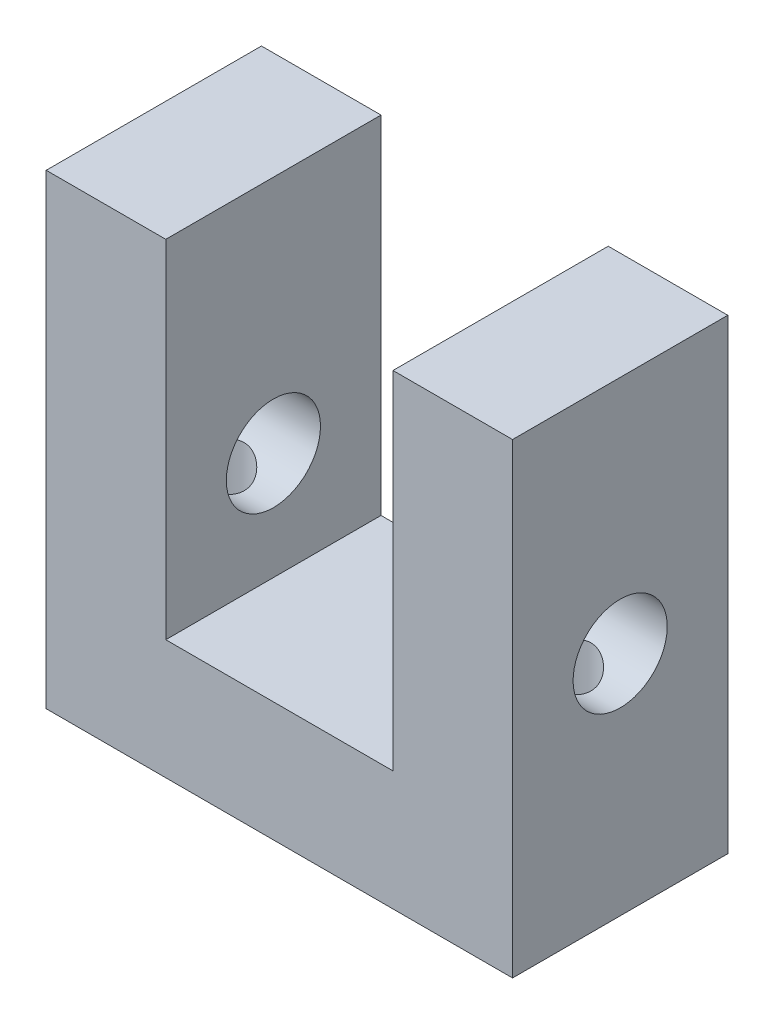
ISO-10303-21;
HEADER;
FILE_DESCRIPTION(('STEP AP214'),'2;1');
FILE_NAME('part.step','',(''),(''),'','','');
FILE_SCHEMA(('AUTOMOTIVE_DESIGN { 1 0 10303 214 1 1 1 1 }'));
ENDSEC;
DATA;
#1=APPLICATION_CONTEXT('core data for automotive mechanical design processes');
#2=APPLICATION_PROTOCOL_DEFINITION('international standard','automotive_design',2000,#1);
#3=PRODUCT_CONTEXT('',#1,'mechanical');
#4=PRODUCT('Part','Part','',(#3));
#5=PRODUCT_RELATED_PRODUCT_CATEGORY('part','',(#4));
#6=PRODUCT_DEFINITION_FORMATION('','',#4);
#7=PRODUCT_DEFINITION_CONTEXT('part definition',#1,'design');
#8=PRODUCT_DEFINITION('design','',#6,#7);
#9=PRODUCT_DEFINITION_SHAPE('','',#8);
#10=(LENGTH_UNIT() NAMED_UNIT(*) SI_UNIT(.MILLI.,.METRE.));
#11=(NAMED_UNIT(*) PLANE_ANGLE_UNIT() SI_UNIT($,.RADIAN.));
#12=(NAMED_UNIT(*) SI_UNIT($,.STERADIAN.) SOLID_ANGLE_UNIT());
#13=UNCERTAINTY_MEASURE_WITH_UNIT(LENGTH_MEASURE(1.E-05),#10,'distance_accuracy_value','');
#14=(GEOMETRIC_REPRESENTATION_CONTEXT(3) GLOBAL_UNCERTAINTY_ASSIGNED_CONTEXT((#13)) GLOBAL_UNIT_ASSIGNED_CONTEXT((#10,
#11,#12)) REPRESENTATION_CONTEXT('',''));
#15=CARTESIAN_POINT('',(0.,0.,0.));
#16=DIRECTION('',(0.,0.,1.));
#17=DIRECTION('',(1.,0.,0.));
#18=AXIS2_PLACEMENT_3D('',#15,#16,#17);
#19=CARTESIAN_POINT('',(-19.5,39.,18.));
#20=DIRECTION('',(1.,0.,0.));
#21=DIRECTION('',(0.,1.,0.));
#22=AXIS2_PLACEMENT_3D('',#19,#20,#21);
#23=PLANE('',#22);
#24=CARTESIAN_POINT('',(-19.5,19.,9.));
#25=DIRECTION('',(1.,0.,0.));
#26=DIRECTION('',(0.,1.,0.));
#27=AXIS2_PLACEMENT_3D('',#24,#25,#26);
#28=CIRCLE('',#27,3.937);
#29=CARTESIAN_POINT('',(-19.5,22.937,9.));
#30=VERTEX_POINT('',#29);
#31=EDGE_CURVE('E168',#30,#30,#28,.T.);
#32=ORIENTED_EDGE('',*,*,#31,.T.);
#33=EDGE_LOOP('',(#32));
#34=FACE_BOUND('',#33,.T.);
#35=DIRECTION('',(0.,-1.,0.));
#36=VECTOR('',#35,1.);
#37=CARTESIAN_POINT('',(-19.5,39.,0.));
#38=LINE('',#37,#36);
#39=CARTESIAN_POINT('',(-19.5,39.,0.));
#40=VERTEX_POINT('',#39);
#41=CARTESIAN_POINT('',(-19.5,0.,0.));
#42=VERTEX_POINT('',#41);
#43=EDGE_CURVE('E139',#40,#42,#38,.T.);
#44=ORIENTED_EDGE('',*,*,#43,.T.);
#45=DIRECTION('',(0.,0.,-1.));
#46=VECTOR('',#45,1.);
#47=CARTESIAN_POINT('',(-19.5,0.,18.));
#48=LINE('',#47,#46);
#49=CARTESIAN_POINT('',(-19.5,0.,18.));
#50=VERTEX_POINT('',#49);
#51=EDGE_CURVE('E11',#50,#42,#48,.T.);
#52=ORIENTED_EDGE('',*,*,#51,.F.);
#53=DIRECTION('',(0.,-1.,0.));
#54=VECTOR('',#53,1.);
#55=CARTESIAN_POINT('',(-19.5,39.,18.));
#56=LINE('',#55,#54);
#57=CARTESIAN_POINT('',(-19.5,39.,18.));
#58=VERTEX_POINT('',#57);
#59=EDGE_CURVE('E154',#58,#50,#56,.T.);
#60=ORIENTED_EDGE('',*,*,#59,.F.);
#61=DIRECTION('',(0.,0.,-1.));
#62=VECTOR('',#61,1.);
#63=CARTESIAN_POINT('',(-19.5,39.,18.));
#64=LINE('',#63,#62);
#65=EDGE_CURVE('E135',#58,#40,#64,.T.);
#66=ORIENTED_EDGE('',*,*,#65,.T.);
#67=EDGE_LOOP('',(#44,#52,#60,#66));
#68=FACE_BOUND('',#67,.T.);
#69=ADVANCED_FACE('F37',(#34,#68),#23,.F.);
#70=CARTESIAN_POINT('',(-19.5,0.,18.));
#71=DIRECTION('',(0.,1.,0.));
#72=DIRECTION('',(0.,0.,1.));
#73=AXIS2_PLACEMENT_3D('',#70,#71,#72);
#74=PLANE('',#73);
#75=CARTESIAN_POINT('',(-14.5,0.,9.));
#76=DIRECTION('',(0.,-1.,0.));
#77=DIRECTION('',(0.,0.,-1.));
#78=AXIS2_PLACEMENT_3D('',#75,#76,#77);
#79=CIRCLE('',#78,2.55269999999999);
#80=CARTESIAN_POINT('',(-14.5,0.,6.44730000000001));
#81=VERTEX_POINT('',#80);
#82=EDGE_CURVE('E228',#81,#81,#79,.T.);
#83=ORIENTED_EDGE('',*,*,#82,.F.);
#84=EDGE_LOOP('',(#83));
#85=FACE_BOUND('',#84,.T.);
#86=CARTESIAN_POINT('',(14.5,0.,9.));
#87=DIRECTION('',(0.,-1.,0.));
#88=DIRECTION('',(0.,0.,-1.));
#89=AXIS2_PLACEMENT_3D('',#86,#87,#88);
#90=CIRCLE('',#89,2.55269999999999);
#91=CARTESIAN_POINT('',(14.5,0.,6.44730000000002));
#92=VERTEX_POINT('',#91);
#93=EDGE_CURVE('E175',#92,#92,#90,.T.);
#94=ORIENTED_EDGE('',*,*,#93,.F.);
#95=EDGE_LOOP('',(#94));
#96=FACE_BOUND('',#95,.T.);
#97=DIRECTION('',(1.,0.,0.));
#98=VECTOR('',#97,1.);
#99=CARTESIAN_POINT('',(-19.5,0.,0.));
#100=LINE('',#99,#98);
#101=CARTESIAN_POINT('',(19.5,0.,0.));
#102=VERTEX_POINT('',#101);
#103=EDGE_CURVE('E142',#42,#102,#100,.T.);
#104=ORIENTED_EDGE('',*,*,#103,.T.);
#105=DIRECTION('',(0.,0.,-1.));
#106=VECTOR('',#105,1.);
#107=CARTESIAN_POINT('',(19.5,0.,18.));
#108=LINE('',#107,#106);
#109=CARTESIAN_POINT('',(19.5,0.,18.));
#110=VERTEX_POINT('',#109);
#111=EDGE_CURVE('E50',#110,#102,#108,.T.);
#112=ORIENTED_EDGE('',*,*,#111,.F.);
#113=DIRECTION('',(1.,0.,0.));
#114=VECTOR('',#113,1.);
#115=CARTESIAN_POINT('',(-19.5,0.,18.));
#116=LINE('',#115,#114);
#117=EDGE_CURVE('E102',#50,#110,#116,.T.);
#118=ORIENTED_EDGE('',*,*,#117,.F.);
#119=ORIENTED_EDGE('',*,*,#51,.T.);
#120=EDGE_LOOP('',(#104,#112,#118,#119));
#121=FACE_BOUND('',#120,.T.);
#122=ADVANCED_FACE('F192',(#85,#96,#121),#74,.F.);
#123=CARTESIAN_POINT('',(19.5,0.,18.));
#124=DIRECTION('',(-1.,0.,0.));
#125=DIRECTION('',(0.,-1.,0.));
#126=AXIS2_PLACEMENT_3D('',#123,#124,#125);
#127=PLANE('',#126);
#128=CARTESIAN_POINT('',(19.5,19.,9.));
#129=DIRECTION('',(1.,0.,0.));
#130=DIRECTION('',(0.,1.,0.));
#131=AXIS2_PLACEMENT_3D('',#128,#129,#130);
#132=CIRCLE('',#131,3.937);
#133=CARTESIAN_POINT('',(19.5,22.937,9.));
#134=VERTEX_POINT('',#133);
#135=EDGE_CURVE('E174',#134,#134,#132,.T.);
#136=ORIENTED_EDGE('',*,*,#135,.F.);
#137=EDGE_LOOP('',(#136));
#138=FACE_BOUND('',#137,.T.);
#139=DIRECTION('',(0.,1.,0.));
#140=VECTOR('',#139,1.);
#141=CARTESIAN_POINT('',(19.5,0.,0.));
#142=LINE('',#141,#140);
#143=CARTESIAN_POINT('',(19.5,39.,0.));
#144=VERTEX_POINT('',#143);
#145=EDGE_CURVE('E145',#102,#144,#142,.T.);
#146=ORIENTED_EDGE('',*,*,#145,.T.);
#147=DIRECTION('',(0.,0.,-1.));
#148=VECTOR('',#147,1.);
#149=CARTESIAN_POINT('',(19.5,39.,18.));
#150=LINE('',#149,#148);
#151=CARTESIAN_POINT('',(19.5,39.,18.));
#152=VERTEX_POINT('',#151);
#153=EDGE_CURVE('E161',#152,#144,#150,.T.);
#154=ORIENTED_EDGE('',*,*,#153,.F.);
#155=DIRECTION('',(0.,1.,0.));
#156=VECTOR('',#155,1.);
#157=CARTESIAN_POINT('',(19.5,0.,18.));
#158=LINE('',#157,#156);
#159=EDGE_CURVE('E213',#110,#152,#158,.T.);
#160=ORIENTED_EDGE('',*,*,#159,.F.);
#161=ORIENTED_EDGE('',*,*,#111,.T.);
#162=EDGE_LOOP('',(#146,#154,#160,#161));
#163=FACE_BOUND('',#162,.T.);
#164=ADVANCED_FACE('F198',(#138,#163),#127,.F.);
#165=CARTESIAN_POINT('',(19.5,39.,18.));
#166=DIRECTION('',(0.,-1.,0.));
#167=DIRECTION('',(0.,0.,-1.));
#168=AXIS2_PLACEMENT_3D('',#165,#166,#167);
#169=PLANE('',#168);
#170=DIRECTION('',(-1.,0.,0.));
#171=VECTOR('',#170,1.);
#172=CARTESIAN_POINT('',(19.5,39.,0.));
#173=LINE('',#172,#171);
#174=CARTESIAN_POINT('',(9.5,39.,0.));
#175=VERTEX_POINT('',#174);
#176=EDGE_CURVE('E147',#144,#175,#173,.T.);
#177=ORIENTED_EDGE('',*,*,#176,.T.);
#178=DIRECTION('',(0.,0.,-1.));
#179=VECTOR('',#178,1.);
#180=CARTESIAN_POINT('',(9.5,39.,18.));
#181=LINE('',#180,#179);
#182=CARTESIAN_POINT('',(9.5,39.,18.));
#183=VERTEX_POINT('',#182);
#184=EDGE_CURVE('E158',#183,#175,#181,.T.);
#185=ORIENTED_EDGE('',*,*,#184,.F.);
#186=DIRECTION('',(-1.,0.,0.));
#187=VECTOR('',#186,1.);
#188=CARTESIAN_POINT('',(19.5,39.,18.));
#189=LINE('',#188,#187);
#190=EDGE_CURVE('E215',#152,#183,#189,.T.);
#191=ORIENTED_EDGE('',*,*,#190,.F.);
#192=ORIENTED_EDGE('',*,*,#153,.T.);
#193=EDGE_LOOP('',(#177,#185,#191,#192));
#194=FACE_BOUND('',#193,.T.);
#195=ADVANCED_FACE('F253',(#194),#169,.F.);
#196=CARTESIAN_POINT('',(9.5,39.,18.));
#197=DIRECTION('',(1.,0.,0.));
#198=DIRECTION('',(0.,1.,0.));
#199=AXIS2_PLACEMENT_3D('',#196,#197,#198);
#200=PLANE('',#199);
#201=CARTESIAN_POINT('',(9.50000000000001,19.,9.));
#202=DIRECTION('',(1.,0.,0.));
#203=DIRECTION('',(0.,1.,0.));
#204=AXIS2_PLACEMENT_3D('',#201,#202,#203);
#205=CIRCLE('',#204,3.937);
#206=CARTESIAN_POINT('',(9.50000000000001,22.937,9.));
#207=VERTEX_POINT('',#206);
#208=EDGE_CURVE('E143',#207,#207,#205,.T.);
#209=ORIENTED_EDGE('',*,*,#208,.T.);
#210=EDGE_LOOP('',(#209));
#211=FACE_BOUND('',#210,.T.);
#212=DIRECTION('',(0.,-1.,0.));
#213=VECTOR('',#212,1.);
#214=CARTESIAN_POINT('',(9.5,39.,0.));
#215=LINE('',#214,#213);
#216=CARTESIAN_POINT('',(9.5,10.,0.));
#217=VERTEX_POINT('',#216);
#218=EDGE_CURVE('E149',#175,#217,#215,.T.);
#219=ORIENTED_EDGE('',*,*,#218,.T.);
#220=DIRECTION('',(0.,0.,-1.));
#221=VECTOR('',#220,1.);
#222=CARTESIAN_POINT('',(9.5,10.,18.));
#223=LINE('',#222,#221);
#224=CARTESIAN_POINT('',(9.5,10.,18.));
#225=VERTEX_POINT('',#224);
#226=EDGE_CURVE('E130',#225,#217,#223,.T.);
#227=ORIENTED_EDGE('',*,*,#226,.F.);
#228=DIRECTION('',(0.,-1.,0.));
#229=VECTOR('',#228,1.);
#230=CARTESIAN_POINT('',(9.5,39.,18.));
#231=LINE('',#230,#229);
#232=EDGE_CURVE('E121',#183,#225,#231,.T.);
#233=ORIENTED_EDGE('',*,*,#232,.F.);
#234=ORIENTED_EDGE('',*,*,#184,.T.);
#235=EDGE_LOOP('',(#219,#227,#233,#234));
#236=FACE_BOUND('',#235,.T.);
#237=ADVANCED_FACE('F247',(#211,#236),#200,.F.);
#238=CARTESIAN_POINT('',(9.5,10.,18.));
#239=DIRECTION('',(0.,-1.,0.));
#240=DIRECTION('',(0.,0.,-1.));
#241=AXIS2_PLACEMENT_3D('',#238,#239,#240);
#242=PLANE('',#241);
#243=DIRECTION('',(-1.,0.,0.));
#244=VECTOR('',#243,1.);
#245=CARTESIAN_POINT('',(9.5,10.,0.));
#246=LINE('',#245,#244);
#247=CARTESIAN_POINT('',(-9.5,10.,0.));
#248=VERTEX_POINT('',#247);
#249=EDGE_CURVE('E129',#217,#248,#246,.T.);
#250=ORIENTED_EDGE('',*,*,#249,.T.);
#251=DIRECTION('',(0.,0.,-1.));
#252=VECTOR('',#251,1.);
#253=CARTESIAN_POINT('',(-9.5,10.,18.));
#254=LINE('',#253,#252);
#255=CARTESIAN_POINT('',(-9.5,10.,18.));
#256=VERTEX_POINT('',#255);
#257=EDGE_CURVE('E126',#256,#248,#254,.T.);
#258=ORIENTED_EDGE('',*,*,#257,.F.);
#259=DIRECTION('',(-1.,0.,0.));
#260=VECTOR('',#259,1.);
#261=CARTESIAN_POINT('',(9.5,10.,18.));
#262=LINE('',#261,#260);
#263=EDGE_CURVE('E115',#225,#256,#262,.T.);
#264=ORIENTED_EDGE('',*,*,#263,.F.);
#265=ORIENTED_EDGE('',*,*,#226,.T.);
#266=EDGE_LOOP('',(#250,#258,#264,#265));
#267=FACE_BOUND('',#266,.T.);
#268=ADVANCED_FACE('F127',(#267),#242,.F.);
#269=CARTESIAN_POINT('',(-9.5,10.,18.));
#270=DIRECTION('',(-1.,0.,0.));
#271=DIRECTION('',(0.,-1.,0.));
#272=AXIS2_PLACEMENT_3D('',#269,#270,#271);
#273=PLANE('',#272);
#274=CARTESIAN_POINT('',(-9.5,19.,9.));
#275=DIRECTION('',(-1.,0.,0.));
#276=DIRECTION('',(0.,-1.,0.));
#277=AXIS2_PLACEMENT_3D('',#274,#275,#276);
#278=CIRCLE('',#277,3.937);
#279=CARTESIAN_POINT('',(-9.5,15.063,9.));
#280=VERTEX_POINT('',#279);
#281=EDGE_CURVE('E166',#280,#280,#278,.T.);
#282=ORIENTED_EDGE('',*,*,#281,.T.);
#283=EDGE_LOOP('',(#282));
#284=FACE_BOUND('',#283,.T.);
#285=DIRECTION('',(0.,1.,0.));
#286=VECTOR('',#285,1.);
#287=CARTESIAN_POINT('',(-9.5,10.,0.));
#288=LINE('',#287,#286);
#289=CARTESIAN_POINT('',(-9.50000000000001,39.,0.));
#290=VERTEX_POINT('',#289);
#291=EDGE_CURVE('E88',#248,#290,#288,.T.);
#292=ORIENTED_EDGE('',*,*,#291,.T.);
#293=DIRECTION('',(0.,0.,-1.));
#294=VECTOR('',#293,1.);
#295=CARTESIAN_POINT('',(-9.50000000000001,39.,18.));
#296=LINE('',#295,#294);
#297=CARTESIAN_POINT('',(-9.50000000000001,39.,18.));
#298=VERTEX_POINT('',#297);
#299=EDGE_CURVE('E131',#298,#290,#296,.T.);
#300=ORIENTED_EDGE('',*,*,#299,.F.);
#301=DIRECTION('',(0.,1.,0.));
#302=VECTOR('',#301,1.);
#303=CARTESIAN_POINT('',(-9.5,10.,18.));
#304=LINE('',#303,#302);
#305=EDGE_CURVE('E119',#256,#298,#304,.T.);
#306=ORIENTED_EDGE('',*,*,#305,.F.);
#307=ORIENTED_EDGE('',*,*,#257,.T.);
#308=EDGE_LOOP('',(#292,#300,#306,#307));
#309=FACE_BOUND('',#308,.T.);
#310=ADVANCED_FACE('F133',(#284,#309),#273,.F.);
#311=CARTESIAN_POINT('',(-9.50000000000001,39.,18.));
#312=DIRECTION('',(0.,-1.,0.));
#313=DIRECTION('',(1.,0.,0.));
#314=AXIS2_PLACEMENT_3D('',#311,#312,#313);
#315=PLANE('',#314);
#316=DIRECTION('',(-1.,0.,0.));
#317=VECTOR('',#316,1.);
#318=CARTESIAN_POINT('',(-9.50000000000001,39.,0.));
#319=LINE('',#318,#317);
#320=EDGE_CURVE('E94',#290,#40,#319,.T.);
#321=ORIENTED_EDGE('',*,*,#320,.T.);
#322=ORIENTED_EDGE('',*,*,#65,.F.);
#323=DIRECTION('',(-1.,0.,0.));
#324=VECTOR('',#323,1.);
#325=CARTESIAN_POINT('',(-9.50000000000001,39.,18.));
#326=LINE('',#325,#324);
#327=EDGE_CURVE('E59',#298,#58,#326,.T.);
#328=ORIENTED_EDGE('',*,*,#327,.F.);
#329=ORIENTED_EDGE('',*,*,#299,.T.);
#330=EDGE_LOOP('',(#321,#322,#328,#329));
#331=FACE_BOUND('',#330,.T.);
#332=ADVANCED_FACE('F240',(#331),#315,.F.);
#333=CARTESIAN_POINT('',(0.,0.,18.));
#334=DIRECTION('',(0.,0.,1.));
#335=DIRECTION('',(1.,0.,0.));
#336=AXIS2_PLACEMENT_3D('',#333,#334,#335);
#337=PLANE('',#336);
#338=ORIENTED_EDGE('',*,*,#59,.T.);
#339=ORIENTED_EDGE('',*,*,#117,.T.);
#340=ORIENTED_EDGE('',*,*,#159,.T.);
#341=ORIENTED_EDGE('',*,*,#190,.T.);
#342=ORIENTED_EDGE('',*,*,#232,.T.);
#343=ORIENTED_EDGE('',*,*,#263,.T.);
#344=ORIENTED_EDGE('',*,*,#305,.T.);
#345=ORIENTED_EDGE('',*,*,#327,.T.);
#346=EDGE_LOOP('',(#338,#339,#340,#341,#342,#343,#344,#345));
#347=FACE_BOUND('',#346,.T.);
#348=ADVANCED_FACE('F117',(#347),#337,.T.);
#349=CARTESIAN_POINT('',(0.,0.,0.));
#350=DIRECTION('',(0.,0.,1.));
#351=DIRECTION('',(1.,0.,0.));
#352=AXIS2_PLACEMENT_3D('',#349,#350,#351);
#353=PLANE('',#352);
#354=ORIENTED_EDGE('',*,*,#43,.F.);
#355=ORIENTED_EDGE('',*,*,#320,.F.);
#356=ORIENTED_EDGE('',*,*,#291,.F.);
#357=ORIENTED_EDGE('',*,*,#249,.F.);
#358=ORIENTED_EDGE('',*,*,#218,.F.);
#359=ORIENTED_EDGE('',*,*,#176,.F.);
#360=ORIENTED_EDGE('',*,*,#145,.F.);
#361=ORIENTED_EDGE('',*,*,#103,.F.);
#362=EDGE_LOOP('',(#354,#355,#356,#357,#358,#359,#360,#361));
#363=FACE_BOUND('',#362,.T.);
#364=ADVANCED_FACE('F207',(#363),#353,.F.);
#365=CARTESIAN_POINT('',(-19.5,19.,9.));
#366=DIRECTION('',(1.,0.,0.));
#367=DIRECTION('',(0.,1.,0.));
#368=AXIS2_PLACEMENT_3D('',#365,#366,#367);
#369=CYLINDRICAL_SURFACE('',#368,3.937);
#370=CARTESIAN_POINT('',(-14.5,16.002719280748,6.44730000000001));
#371=CARTESIAN_POINT('',(-14.4371393728023,16.0027223438406,6.44729812919539));
#372=CARTESIAN_POINT('',(-14.3742955930967,16.0007329534528,6.44962640561601));
#373=CARTESIAN_POINT('',(-14.249182800711,15.9928924859204,6.45887669833673));
#374=CARTESIAN_POINT('',(-14.1869139477669,15.9870403664721,6.46579995453093));
#375=CARTESIAN_POINT('',(-14.0016374740319,15.964031845289,6.49331478376425));
#376=CARTESIAN_POINT('',(-13.8802329113491,15.9414237453145,6.52065120482433));
#377=CARTESIAN_POINT('',(-13.6462229835699,15.8855624013916,6.591222675012));
#378=CARTESIAN_POINT('',(-13.5335485930963,15.8524062380573,6.63431324821302));
#379=CARTESIAN_POINT('',(-13.3171555717831,15.7793727051945,6.73474337339725));
#380=CARTESIAN_POINT('',(-13.2134389287416,15.7394938496109,6.79208607715466));
#381=CARTESIAN_POINT('',(-13.001347954788,15.6505135439433,6.92912997279824));
#382=CARTESIAN_POINT('',(-12.8945005518559,15.600915287351,7.01087233643893));
#383=CARTESIAN_POINT('',(-12.694733730064,15.502122363775,7.19020855036278));
#384=CARTESIAN_POINT('',(-12.6018270057242,15.4529281027385,7.28781668172087));
#385=CARTESIAN_POINT('',(-12.4201953635803,15.3527004116614,7.51200962350713));
#386=CARTESIAN_POINT('',(-12.3336867966122,15.3022990906964,7.64072345198957));
#387=CARTESIAN_POINT('',(-12.2216785445867,15.2352205158734,7.84603821084825));
#388=CARTESIAN_POINT('',(-12.1872945487938,15.2142769725733,7.91653820567028));
#389=CARTESIAN_POINT('',(-12.1249012540365,15.1758429338826,8.06118560469413));
#390=CARTESIAN_POINT('',(-12.0968873637527,15.1583499526767,8.13533033473717));
#391=CARTESIAN_POINT('',(-12.0503356815028,15.1290495490551,8.27856223048723));
#392=CARTESIAN_POINT('',(-12.0311046045123,15.1168340079681,8.34734144415776));
#393=CARTESIAN_POINT('',(-11.9984058645738,15.0959628344503,8.48674990310246));
#394=CARTESIAN_POINT('',(-11.9849347574645,15.087305074773,8.5573780159416));
#395=CARTESIAN_POINT('',(-11.9639884614258,15.0738083015734,8.69983498692896));
#396=CARTESIAN_POINT('',(-11.956509059794,15.0689666050577,8.77166296512819));
#397=CARTESIAN_POINT('',(-11.9476646418764,15.0632374836349,8.91582544316401));
#398=CARTESIAN_POINT('',(-11.9462988363941,15.062349548342,8.98815987641546));
#399=CARTESIAN_POINT('',(-11.9509499746763,15.0653687343311,9.18398272256103));
#400=CARTESIAN_POINT('',(-11.9628946866377,15.0731263387937,9.30734042034621));
#401=CARTESIAN_POINT('',(-12.0041700270959,15.0996644243618,9.54978942403841));
#402=CARTESIAN_POINT('',(-12.0335019515442,15.1184457271147,9.66888041122554));
#403=CARTESIAN_POINT('',(-12.1080779908779,15.1654015855873,9.89983362010796));
#404=CARTESIAN_POINT('',(-12.1533075496761,15.1935675473634,10.0117023440675));
#405=CARTESIAN_POINT('',(-12.2579576695255,15.2571772754305,10.2262928032976));
#406=CARTESIAN_POINT('',(-12.3173810791299,15.2926225023912,10.329012696808));
#407=CARTESIAN_POINT('',(-12.4572531996023,15.3733177967285,10.5365803279711));
#408=CARTESIAN_POINT('',(-12.5394228660352,15.4192425560891,10.6400035895108));
#409=CARTESIAN_POINT('',(-12.7180062843382,15.5138201000995,10.8324987756622));
#410=CARTESIAN_POINT('',(-12.8144416454063,15.5624769526202,10.9215484921357));
#411=CARTESIAN_POINT('',(-13.035083634895,15.6655165140941,11.0959112241815));
#412=CARTESIAN_POINT('',(-13.1612896187079,15.71971078904,11.1788254258192));
#413=CARTESIAN_POINT('',(-13.4289689648654,15.8195137029538,11.3220917878698));
#414=CARTESIAN_POINT('',(-13.5704146078432,15.8651375292965,11.3824840493825));
#415=CARTESIAN_POINT('',(-13.8250555284106,15.9294044199454,11.4644150548386));
#416=CARTESIAN_POINT('',(-13.9352696522811,15.9520188595981,11.4920773149032));
#417=CARTESIAN_POINT('',(-14.1600626396891,15.9855401873677,11.5325306921144));
#418=CARTESIAN_POINT('',(-14.2746343568334,15.9964654551456,11.5453451580735));
#419=CARTESIAN_POINT('',(-14.5053600829248,16.0049372720928,11.5553123314967));
#420=CARTESIAN_POINT('',(-14.6215181018767,16.0024389606483,11.5524125227344));
#421=CARTESIAN_POINT('',(-14.8513923515296,15.9843746066364,11.5310375750578));
#422=CARTESIAN_POINT('',(-14.9651064605232,15.9687976452063,11.5125494219789));
#423=CARTESIAN_POINT('',(-15.1833192748111,15.9276264904077,11.4620099097348));
#424=CARTESIAN_POINT('',(-15.287999191928,15.9023861316808,11.4304347049205));
#425=CARTESIAN_POINT('',(-15.4907240852625,15.8447246679626,11.3550906240485));
#426=CARTESIAN_POINT('',(-15.5887668604742,15.8123011959926,11.3113177273801));
#427=CARTESIAN_POINT('',(-15.7959956099002,15.7362219458352,11.2029329130454));
#428=CARTESIAN_POINT('',(-15.9035703550829,15.6916118099502,11.1359142950699));
#429=CARTESIAN_POINT('',(-16.1071823482744,15.600229077879,10.9872492188427));
#430=CARTESIAN_POINT('',(-16.2032054557364,15.5534539264809,10.9055851312243));
#431=CARTESIAN_POINT('',(-16.3998520553012,15.4525079527909,10.711550520667));
#432=CARTESIAN_POINT('',(-16.4978168101448,15.3986422062207,10.5962948722424));
#433=CARTESIAN_POINT('',(-16.6730194469479,15.2985746331084,10.3480614597899));
#434=CARTESIAN_POINT('',(-16.7502788483235,15.2523648688039,10.2151023121875));
#435=CARTESIAN_POINT('',(-16.8676715226623,15.180593411578,9.96218624950526));
#436=CARTESIAN_POINT('',(-16.9121296377146,15.1527540237355,9.8448842016154));
#437=CARTESIAN_POINT('',(-16.9836081807278,15.1075421292439,9.60316981145063));
#438=CARTESIAN_POINT('',(-17.0106429021552,15.0901610437941,9.47876338877647));
#439=CARTESIAN_POINT('',(-17.0459161863579,15.0674186259175,9.22573608368804));
#440=CARTESIAN_POINT('',(-17.054086550919,15.0621009060431,9.09710160978952));
#441=CARTESIAN_POINT('',(-17.0509280351495,15.0641489859113,8.84016693196848));
#442=CARTESIAN_POINT('',(-17.0395986104218,15.0715151397637,8.71186673747857));
#443=CARTESIAN_POINT('',(-16.9993450065693,15.0974109954586,8.46703094961412));
#444=CARTESIAN_POINT('',(-16.9714812105403,15.1152673035343,8.35024490507898));
#445=CARTESIAN_POINT('',(-16.9003923228599,15.1601020537722,8.12333528427385));
#446=CARTESIAN_POINT('',(-16.8571647771546,15.1870819532134,8.0132127756618));
#447=CARTESIAN_POINT('',(-16.7534149424686,15.2503653098875,7.79413284560427));
#448=CARTESIAN_POINT('',(-16.6918871051745,15.2871925333049,7.68580657116465));
#449=CARTESIAN_POINT('',(-16.5549377700646,15.366360137364,7.48054072090175));
#450=CARTESIAN_POINT('',(-16.4795061273179,15.4087045369648,7.38360954465891));
#451=CARTESIAN_POINT('',(-16.3036332712858,15.5027984521711,7.18807809243294));
#452=CARTESIAN_POINT('',(-16.2011280443322,15.5549889465369,7.09154398437157));
#453=CARTESIAN_POINT('',(-15.9812223986318,15.6581029813104,6.91624424497591));
#454=CARTESIAN_POINT('',(-15.8638151588297,15.7090259286791,6.83748679665737));
#455=CARTESIAN_POINT('',(-15.6306884540852,15.7981229443711,6.70798021566972));
#456=CARTESIAN_POINT('',(-15.5165297077345,15.8370946423501,6.65498011216175));
#457=CARTESIAN_POINT('',(-15.2791487730174,15.9051719410969,6.56583079949214));
#458=CARTESIAN_POINT('',(-15.1559493482829,15.9343013521189,6.52964084284998));
#459=CARTESIAN_POINT('',(-14.9433757683476,15.9712963928198,6.48455271478876));
#460=CARTESIAN_POINT('',(-14.8557102816637,15.9829786325794,6.47063478808774));
#461=CARTESIAN_POINT('',(-14.6786850063819,15.9986872827889,6.4520105027885));
#462=CARTESIAN_POINT('',(-14.5893254934112,16.0027149280669,6.44730265842949));
#463=CARTESIAN_POINT('',(-14.5,16.002719280748,6.44730000000001));
#464=B_SPLINE_CURVE_WITH_KNOTS('',3,(#370,#371,#372,#373,#374,#375,#376,#377,#378,#379,#380,
#381,#382,#383,#384,#385,#386,#387,#388,#389,#390,#391,#392,#393,#394,#395,#396,#397,#398,#399,
#400,#401,#402,#403,#404,#405,#406,#407,#408,#409,#410,#411,#412,#413,#414,#415,#416,#417,#418,
#419,#420,#421,#422,#423,#424,#425,#426,#427,#428,#429,#430,#431,#432,#433,#434,#435,#436,#437,
#438,#439,#440,#441,#442,#443,#444,#445,#446,#447,#448,#449,#450,#451,#452,#453,#454,#455,#456,
#457,#458,#459,#460,#461,#462,#463),.UNSPECIFIED.,.T.,.F.,(4,2,2,2,2,2,2,2,2,2,2,2,2,2,2,2,2,2,
2,2,2,2,2,2,2,2,2,2,2,2,2,2,2,2,2,2,2,2,2,2,2,2,2,2,2,2,4),(0.,0.188473202224939,
0.376997282120968,0.754260834931842,1.12814802881716,1.50211797932264,1.93063098320897,
2.3595318576336,2.84572461831033,3.08895480960375,3.33200913058618,3.54905150415348,
3.76596391560749,3.9827236841437,4.19945547062721,4.5700090189581,4.9405901898764,
5.31083293181432,5.68115004000751,6.09907985627009,6.51764934703137,6.99669474807591,
7.47488307285159,7.82105792148542,8.16668765286511,8.51347317029198,8.86054849384436,
9.19597244268598,9.53150708522511,9.93316032570962,10.335300338566,10.8146788323088,
11.2935571507176,11.6774151984033,12.0609579418572,12.4458851082514,12.8308230212591,
13.1933983997383,13.5560317184809,13.9442669847795,14.3327866569687,14.7814735559625,
15.2303665767975,15.6241769730904,16.0170277337407,16.2848929949615,16.5527150408757),.UNSPECIFIED.);
#465=CARTESIAN_POINT('',(-14.5,16.002719280748,6.44730000000001));
#466=VERTEX_POINT('',#465);
#467=EDGE_CURVE('E40',#466,#466,#464,.T.);
#468=ORIENTED_EDGE('',*,*,#467,.T.);
#469=EDGE_LOOP('',(#468));
#470=FACE_BOUND('',#469,.T.);
#471=ORIENTED_EDGE('',*,*,#31,.F.);
#472=EDGE_LOOP('',(#471));
#473=FACE_BOUND('',#472,.T.);
#474=ORIENTED_EDGE('',*,*,#281,.F.);
#475=EDGE_LOOP('',(#474));
#476=FACE_BOUND('',#475,.T.);
#477=ADVANCED_FACE('F233',(#470,#473,#476),#369,.F.);
#478=CARTESIAN_POINT('',(14.5,16.002719280748,6.44730000000001));
#479=CARTESIAN_POINT('',(14.5628606271977,16.0027223438406,6.4472981291954));
#480=CARTESIAN_POINT('',(14.6257044069033,16.0007329534528,6.44962640561601));
#481=CARTESIAN_POINT('',(14.750817199289,15.9928924859204,6.45887669833673));
#482=CARTESIAN_POINT('',(14.8130860522331,15.9870403664721,6.46579995453093));
#483=CARTESIAN_POINT('',(14.9983625259681,15.9640318452889,6.49331478376425));
#484=CARTESIAN_POINT('',(15.1197670886509,15.9414237453145,6.52065120482433));
#485=CARTESIAN_POINT('',(15.3537770164301,15.8855624013916,6.59122267501201));
#486=CARTESIAN_POINT('',(15.4664514069037,15.8524062380573,6.63431324821303));
#487=CARTESIAN_POINT('',(15.6828444282169,15.7793727051945,6.73474337339725));
#488=CARTESIAN_POINT('',(15.7865610712584,15.7394938496109,6.79208607715467));
#489=CARTESIAN_POINT('',(15.998652045212,15.6505135439433,6.92912997279825));
#490=CARTESIAN_POINT('',(16.1054994481441,15.600915287351,7.01087233643894));
#491=CARTESIAN_POINT('',(16.3052662699361,15.502122363775,7.19020855036279));
#492=CARTESIAN_POINT('',(16.3981729942758,15.4529281027385,7.28781668172088));
#493=CARTESIAN_POINT('',(16.5798046364197,15.3527004116614,7.51200962350714));
#494=CARTESIAN_POINT('',(16.6663132033878,15.3022990906964,7.64072345198958));
#495=CARTESIAN_POINT('',(16.7783214554133,15.2352205158734,7.84603821084826));
#496=CARTESIAN_POINT('',(16.8127054512062,15.2142769725733,7.91653820567029));
#497=CARTESIAN_POINT('',(16.8750987459635,15.1758429338826,8.06118560469414));
#498=CARTESIAN_POINT('',(16.9031126362473,15.1583499526767,8.13533033473718));
#499=CARTESIAN_POINT('',(16.9496643184972,15.1290495490551,8.27856223048724));
#500=CARTESIAN_POINT('',(16.9688953954877,15.1168340079681,8.34734144415776));
#501=CARTESIAN_POINT('',(17.0015941354262,15.0959628344503,8.48674990310247));
#502=CARTESIAN_POINT('',(17.0150652425356,15.087305074773,8.55737801594161));
#503=CARTESIAN_POINT('',(17.0360115385742,15.0738083015734,8.69983498692896));
#504=CARTESIAN_POINT('',(17.043490940206,15.0689666050577,8.7716629651282));
#505=CARTESIAN_POINT('',(17.0523353581236,15.0632374836349,8.91582544316401));
#506=CARTESIAN_POINT('',(17.0537011636059,15.062349548342,8.98815987641546));
#507=CARTESIAN_POINT('',(17.0490500253237,15.0653687343311,9.18398272256104));
#508=CARTESIAN_POINT('',(17.0371053133623,15.0731263387937,9.30734042034621));
#509=CARTESIAN_POINT('',(16.9958299729041,15.0996644243618,9.54978942403842));
#510=CARTESIAN_POINT('',(16.9664980484558,15.1184457271147,9.66888041122555));
#511=CARTESIAN_POINT('',(16.8919220091221,15.1654015855873,9.89983362010796));
#512=CARTESIAN_POINT('',(16.846692450324,15.1935675473634,10.0117023440675));
#513=CARTESIAN_POINT('',(16.7420423304745,15.2571772754305,10.2262928032976));
#514=CARTESIAN_POINT('',(16.6826189208701,15.2926225023912,10.329012696808));
#515=CARTESIAN_POINT('',(16.5427468003977,15.3733177967285,10.5365803279711));
#516=CARTESIAN_POINT('',(16.4605771339648,15.4192425560891,10.6400035895108));
#517=CARTESIAN_POINT('',(16.2819937156618,15.5138201000995,10.8324987756622));
#518=CARTESIAN_POINT('',(16.1855583545937,15.5624769526202,10.9215484921357));
#519=CARTESIAN_POINT('',(15.964916365105,15.6655165140941,11.0959112241815));
#520=CARTESIAN_POINT('',(15.8387103812921,15.71971078904,11.1788254258192));
#521=CARTESIAN_POINT('',(15.5710310351346,15.8195137029538,11.3220917878698));
#522=CARTESIAN_POINT('',(15.4295853921568,15.8651375292965,11.3824840493825));
#523=CARTESIAN_POINT('',(15.1749444715894,15.9294044199454,11.4644150548386));
#524=CARTESIAN_POINT('',(15.0647303477189,15.9520188595981,11.4920773149032));
#525=CARTESIAN_POINT('',(14.8399373603109,15.9855401873677,11.5325306921144));
#526=CARTESIAN_POINT('',(14.7253656431666,15.9964654551456,11.5453451580735));
#527=CARTESIAN_POINT('',(14.4946399170752,16.0049372720928,11.5553123314967));
#528=CARTESIAN_POINT('',(14.3784818981233,16.0024389606483,11.5524125227344));
#529=CARTESIAN_POINT('',(14.1486076484704,15.9843746066364,11.5310375750578));
#530=CARTESIAN_POINT('',(14.0348935394768,15.9687976452063,11.512549421979));
#531=CARTESIAN_POINT('',(13.8166807251889,15.9276264904077,11.4620099097348));
#532=CARTESIAN_POINT('',(13.712000808072,15.9023861316808,11.4304347049205));
#533=CARTESIAN_POINT('',(13.5092759147375,15.8447246679626,11.3550906240485));
#534=CARTESIAN_POINT('',(13.4112331395258,15.8123011959926,11.3113177273801));
#535=CARTESIAN_POINT('',(13.2040043900999,15.7362219458352,11.2029329130454));
#536=CARTESIAN_POINT('',(13.0964296449171,15.6916118099502,11.1359142950699));
#537=CARTESIAN_POINT('',(12.8928176517256,15.600229077879,10.9872492188427));
#538=CARTESIAN_POINT('',(12.7967945442637,15.5534539264809,10.9055851312243));
#539=CARTESIAN_POINT('',(12.6001479446988,15.4525079527909,10.711550520667));
#540=CARTESIAN_POINT('',(12.5021831898552,15.3986422062207,10.5962948722424));
#541=CARTESIAN_POINT('',(12.3269805530521,15.2985746331084,10.3480614597899));
#542=CARTESIAN_POINT('',(12.2497211516765,15.2523648688039,10.2151023121875));
#543=CARTESIAN_POINT('',(12.1323284773377,15.180593411578,9.96218624950527));
#544=CARTESIAN_POINT('',(12.0878703622854,15.1527540237355,9.8448842016154));
#545=CARTESIAN_POINT('',(12.0163918192722,15.1075421292439,9.60316981145063));
#546=CARTESIAN_POINT('',(11.9893570978448,15.0901610437941,9.47876338877647));
#547=CARTESIAN_POINT('',(11.9540838136421,15.0674186259175,9.22573608368804));
#548=CARTESIAN_POINT('',(11.9459134490811,15.0621009060431,9.09710160978952));
#549=CARTESIAN_POINT('',(11.9490719648505,15.0641489859113,8.84016693196848));
#550=CARTESIAN_POINT('',(11.9604013895782,15.0715151397636,8.71186673747857));
#551=CARTESIAN_POINT('',(12.0006549934307,15.0974109954586,8.46703094961412));
#552=CARTESIAN_POINT('',(12.0285187894597,15.1152673035343,8.35024490507898));
#553=CARTESIAN_POINT('',(12.0996076771401,15.1601020537722,8.12333528427385));
#554=CARTESIAN_POINT('',(12.1428352228454,15.1870819532134,8.0132127756618));
#555=CARTESIAN_POINT('',(12.2465850575314,15.2503653098875,7.79413284560427));
#556=CARTESIAN_POINT('',(12.3081128948255,15.2871925333049,7.68580657116465));
#557=CARTESIAN_POINT('',(12.4450622299354,15.366360137364,7.48054072090175));
#558=CARTESIAN_POINT('',(12.5204938726821,15.4087045369648,7.38360954465891));
#559=CARTESIAN_POINT('',(12.6963667287142,15.5027984521711,7.18807809243294));
#560=CARTESIAN_POINT('',(12.7988719556678,15.5549889465369,7.09154398437157));
#561=CARTESIAN_POINT('',(13.0187776013682,15.6581029813104,6.91624424497591));
#562=CARTESIAN_POINT('',(13.1361848411703,15.7090259286791,6.83748679665738));
#563=CARTESIAN_POINT('',(13.3693115459148,15.7981229443711,6.70798021566972));
#564=CARTESIAN_POINT('',(13.4834702922655,15.8370946423501,6.65498011216175));
#565=CARTESIAN_POINT('',(13.7208512269827,15.9051719410969,6.56583079949215));
#566=CARTESIAN_POINT('',(13.8440506517171,15.9343013521189,6.52964084284999));
#567=CARTESIAN_POINT('',(14.0566242316524,15.9712963928198,6.48455271478876));
#568=CARTESIAN_POINT('',(14.1442897183363,15.9829786325794,6.47063478808774));
#569=CARTESIAN_POINT('',(14.3213149936181,15.9986872827889,6.45201050278851));
#570=CARTESIAN_POINT('',(14.4106745065888,16.0027149280669,6.4473026584295));
#571=CARTESIAN_POINT('',(14.5,16.002719280748,6.44730000000001));
#572=B_SPLINE_CURVE_WITH_KNOTS('',3,(#478,#479,#480,#481,#482,#483,#484,#485,#486,#487,#488,
#489,#490,#491,#492,#493,#494,#495,#496,#497,#498,#499,#500,#501,#502,#503,#504,#505,#506,#507,
#508,#509,#510,#511,#512,#513,#514,#515,#516,#517,#518,#519,#520,#521,#522,#523,#524,#525,#526,
#527,#528,#529,#530,#531,#532,#533,#534,#535,#536,#537,#538,#539,#540,#541,#542,#543,#544,#545,
#546,#547,#548,#549,#550,#551,#552,#553,#554,#555,#556,#557,#558,#559,#560,#561,#562,#563,#564,
#565,#566,#567,#568,#569,#570,#571),.UNSPECIFIED.,.T.,.F.,(4,2,2,2,2,2,2,2,2,2,2,2,2,2,2,2,2,2,
2,2,2,2,2,2,2,2,2,2,2,2,2,2,2,2,2,2,2,2,2,2,2,2,2,2,2,2,4),(0.,0.188473202224939,
0.376997282120968,0.754260834931844,1.12814802881717,1.50211797932263,1.93063098320898,
2.3595318576336,2.84572461831033,3.08895480960375,3.33200913058619,3.54905150415349,
3.76596391560749,3.98272368414371,4.19945547062721,4.5700090189581,4.9405901898764,
5.31083293181432,5.68115004000751,6.09907985627009,6.51764934703137,6.99669474807591,
7.4748830728516,7.82105792148542,8.16668765286511,8.51347317029198,8.86054849384435,
9.19597244268598,9.53150708522511,9.93316032570961,10.335300338566,10.8146788323088,
11.2935571507176,11.6774151984033,12.0609579418572,12.4458851082514,12.8308230212591,
13.1933983997383,13.5560317184809,13.9442669847795,14.3327866569687,14.7814735559625,
15.2303665767975,15.6241769730904,16.0170277337407,16.2848929949615,16.5527150408757),.UNSPECIFIED.);
#573=CARTESIAN_POINT('',(14.5,16.002719280748,6.44730000000001));
#574=VERTEX_POINT('',#573);
#575=EDGE_CURVE('E169',#574,#574,#572,.T.);
#576=ORIENTED_EDGE('',*,*,#575,.T.);
#577=EDGE_LOOP('',(#576));
#578=FACE_BOUND('',#577,.T.);
#579=ORIENTED_EDGE('',*,*,#135,.T.);
#580=EDGE_LOOP('',(#579));
#581=FACE_BOUND('',#580,.T.);
#582=ORIENTED_EDGE('',*,*,#208,.F.);
#583=EDGE_LOOP('',(#582));
#584=FACE_BOUND('',#583,.T.);
#585=ADVANCED_FACE('F176',(#578,#581,#584),#369,.F.);
#586=CARTESIAN_POINT('',(14.5,0.,9.));
#587=DIRECTION('',(0.,-1.,0.));
#588=DIRECTION('',(0.,0.,-1.));
#589=AXIS2_PLACEMENT_3D('',#586,#587,#588);
#590=CYLINDRICAL_SURFACE('',#589,2.55269999999999);
#591=ORIENTED_EDGE('',*,*,#93,.T.);
#592=EDGE_LOOP('',(#591));
#593=FACE_BOUND('',#592,.T.);
#594=ORIENTED_EDGE('',*,*,#575,.F.);
#595=EDGE_LOOP('',(#594));
#596=FACE_BOUND('',#595,.T.);
#597=ADVANCED_FACE('F179',(#593,#596),#590,.F.);
#598=CARTESIAN_POINT('',(-14.5,0.,9.));
#599=DIRECTION('',(0.,-1.,0.));
#600=DIRECTION('',(0.,0.,-1.));
#601=AXIS2_PLACEMENT_3D('',#598,#599,#600);
#602=CYLINDRICAL_SURFACE('',#601,2.55269999999999);
#603=ORIENTED_EDGE('',*,*,#82,.T.);
#604=EDGE_LOOP('',(#603));
#605=FACE_BOUND('',#604,.T.);
#606=ORIENTED_EDGE('',*,*,#467,.F.);
#607=EDGE_LOOP('',(#606));
#608=FACE_BOUND('',#607,.T.);
#609=ADVANCED_FACE('F182',(#605,#608),#602,.F.);
#610=CLOSED_SHELL('',(#69,#122,#164,#195,#237,#268,#310,#332,#348,#364,#477,#585,#597,#609));
#611=MANIFOLD_SOLID_BREP('B2',#610);
#612=ADVANCED_BREP_SHAPE_REPRESENTATION('',(#18,#611),#14);
#613=SHAPE_DEFINITION_REPRESENTATION(#9,#612);
ENDSEC;
END-ISO-10303-21;
